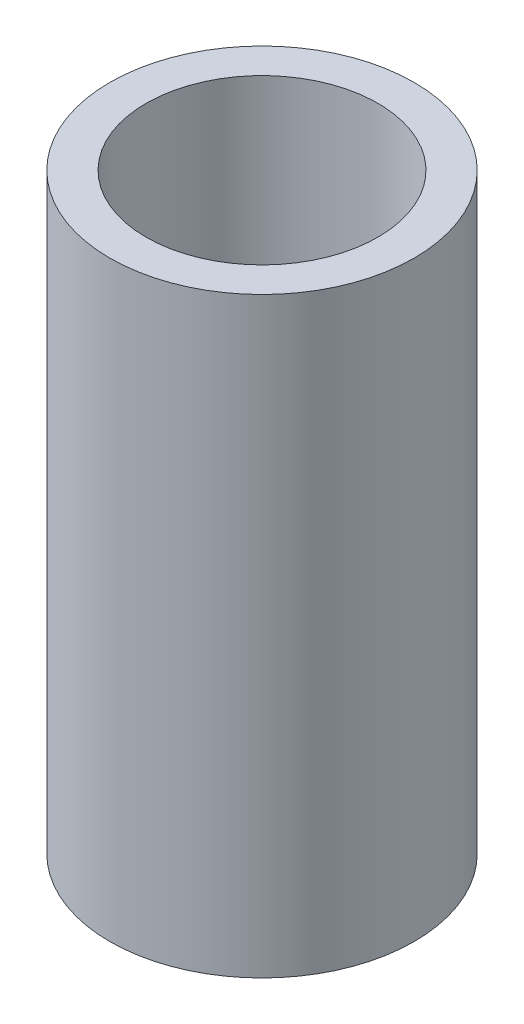
ISO-10303-21;
HEADER;
FILE_DESCRIPTION(('STEP AP214'),'2;1');
FILE_NAME('part.step','',(''),(''),'','','');
FILE_SCHEMA(('AUTOMOTIVE_DESIGN { 1 0 10303 214 1 1 1 1 }'));
ENDSEC;
DATA;
#1=APPLICATION_CONTEXT('core data for automotive mechanical design processes');
#2=APPLICATION_PROTOCOL_DEFINITION('international standard','automotive_design',2000,#1);
#3=PRODUCT_CONTEXT('',#1,'mechanical');
#4=PRODUCT('Part','Part','',(#3));
#5=PRODUCT_RELATED_PRODUCT_CATEGORY('part','',(#4));
#6=PRODUCT_DEFINITION_FORMATION('','',#4);
#7=PRODUCT_DEFINITION_CONTEXT('part definition',#1,'design');
#8=PRODUCT_DEFINITION('design','',#6,#7);
#9=PRODUCT_DEFINITION_SHAPE('','',#8);
#10=(LENGTH_UNIT() NAMED_UNIT(*) SI_UNIT(.MILLI.,.METRE.));
#11=(NAMED_UNIT(*) PLANE_ANGLE_UNIT() SI_UNIT($,.RADIAN.));
#12=(NAMED_UNIT(*) SI_UNIT($,.STERADIAN.) SOLID_ANGLE_UNIT());
#13=UNCERTAINTY_MEASURE_WITH_UNIT(LENGTH_MEASURE(1.E-05),#10,'distance_accuracy_value','');
#14=(GEOMETRIC_REPRESENTATION_CONTEXT(3) GLOBAL_UNCERTAINTY_ASSIGNED_CONTEXT((#13)) GLOBAL_UNIT_ASSIGNED_CONTEXT((#10,
#11,#12)) REPRESENTATION_CONTEXT('',''));
#15=CARTESIAN_POINT('',(0.,0.,0.));
#16=DIRECTION('',(0.,0.,1.));
#17=DIRECTION('',(1.,0.,0.));
#18=AXIS2_PLACEMENT_3D('',#15,#16,#17);
#19=CARTESIAN_POINT('',(0.,155.587785412609,0.));
#20=DIRECTION('',(0.,-1.,0.));
#21=DIRECTION('',(0.,0.,-1.));
#22=AXIS2_PLACEMENT_3D('',#19,#20,#21);
#23=CYLINDRICAL_SURFACE('',#22,40.);
#24=CARTESIAN_POINT('',(0.,155.587785412609,0.));
#25=DIRECTION('',(0.,1.,0.));
#26=DIRECTION('',(0.,0.,1.));
#27=AXIS2_PLACEMENT_3D('',#24,#25,#26);
#28=CIRCLE('',#27,40.);
#29=CARTESIAN_POINT('',(0.,155.587785412609,40.));
#30=VERTEX_POINT('',#29);
#31=EDGE_CURVE('E10',#30,#30,#28,.T.);
#32=ORIENTED_EDGE('',*,*,#31,.F.);
#33=EDGE_LOOP('',(#32));
#34=FACE_BOUND('',#33,.T.);
#35=CARTESIAN_POINT('',(0.,0.,0.));
#36=DIRECTION('',(0.,1.,0.));
#37=DIRECTION('',(0.,0.,1.));
#38=AXIS2_PLACEMENT_3D('',#35,#36,#37);
#39=CIRCLE('',#38,40.);
#40=CARTESIAN_POINT('',(0.,0.,40.));
#41=VERTEX_POINT('',#40);
#42=EDGE_CURVE('E37',#41,#41,#39,.T.);
#43=ORIENTED_EDGE('',*,*,#42,.T.);
#44=EDGE_LOOP('',(#43));
#45=FACE_BOUND('',#44,.T.);
#46=ADVANCED_FACE('F40',(#34,#45),#23,.T.);
#47=CARTESIAN_POINT('',(0.,155.587785412609,0.));
#48=DIRECTION('',(0.,1.,0.));
#49=DIRECTION('',(0.,0.,1.));
#50=AXIS2_PLACEMENT_3D('',#47,#48,#49);
#51=PLANE('',#50);
#52=CARTESIAN_POINT('',(0.,155.587785412609,0.));
#53=DIRECTION('',(0.,1.,0.));
#54=DIRECTION('',(0.,0.,1.));
#55=AXIS2_PLACEMENT_3D('',#52,#53,#54);
#56=CIRCLE('',#55,30.4805768352836);
#57=CARTESIAN_POINT('',(0.,155.587785412609,30.4805768352836));
#58=VERTEX_POINT('',#57);
#59=EDGE_CURVE('E50',#58,#58,#56,.T.);
#60=ORIENTED_EDGE('',*,*,#59,.F.);
#61=EDGE_LOOP('',(#60));
#62=FACE_BOUND('',#61,.T.);
#63=ORIENTED_EDGE('',*,*,#31,.T.);
#64=EDGE_LOOP('',(#63));
#65=FACE_BOUND('',#64,.T.);
#66=ADVANCED_FACE('F59',(#62,#65),#51,.T.);
#67=CARTESIAN_POINT('',(0.,0.,0.));
#68=DIRECTION('',(0.,1.,0.));
#69=DIRECTION('',(0.,0.,1.));
#70=AXIS2_PLACEMENT_3D('',#67,#68,#69);
#71=PLANE('',#70);
#72=CARTESIAN_POINT('',(0.,0.,0.));
#73=DIRECTION('',(0.,1.,0.));
#74=DIRECTION('',(0.,0.,1.));
#75=AXIS2_PLACEMENT_3D('',#72,#73,#74);
#76=CIRCLE('',#75,30.4805768352836);
#77=CARTESIAN_POINT('',(0.,0.,30.4805768352836));
#78=VERTEX_POINT('',#77);
#79=EDGE_CURVE('E47',#78,#78,#76,.T.);
#80=ORIENTED_EDGE('',*,*,#79,.T.);
#81=EDGE_LOOP('',(#80));
#82=FACE_BOUND('',#81,.T.);
#83=ORIENTED_EDGE('',*,*,#42,.F.);
#84=EDGE_LOOP('',(#83));
#85=FACE_BOUND('',#84,.T.);
#86=ADVANCED_FACE('F58',(#82,#85),#71,.F.);
#87=CARTESIAN_POINT('',(0.,155.587785412609,0.));
#88=DIRECTION('',(0.,-1.,0.));
#89=DIRECTION('',(0.,0.,-1.));
#90=AXIS2_PLACEMENT_3D('',#87,#88,#89);
#91=CYLINDRICAL_SURFACE('',#90,30.4805768352836);
#92=ORIENTED_EDGE('',*,*,#59,.T.);
#93=EDGE_LOOP('',(#92));
#94=FACE_BOUND('',#93,.T.);
#95=ORIENTED_EDGE('',*,*,#79,.F.);
#96=EDGE_LOOP('',(#95));
#97=FACE_BOUND('',#96,.T.);
#98=ADVANCED_FACE('F54',(#94,#97),#91,.F.);
#99=CLOSED_SHELL('',(#46,#66,#86,#98));
#100=MANIFOLD_SOLID_BREP('B2',#99);
#101=ADVANCED_BREP_SHAPE_REPRESENTATION('',(#18,#100),#14);
#102=SHAPE_DEFINITION_REPRESENTATION(#9,#101);
ENDSEC;
END-ISO-10303-21;
